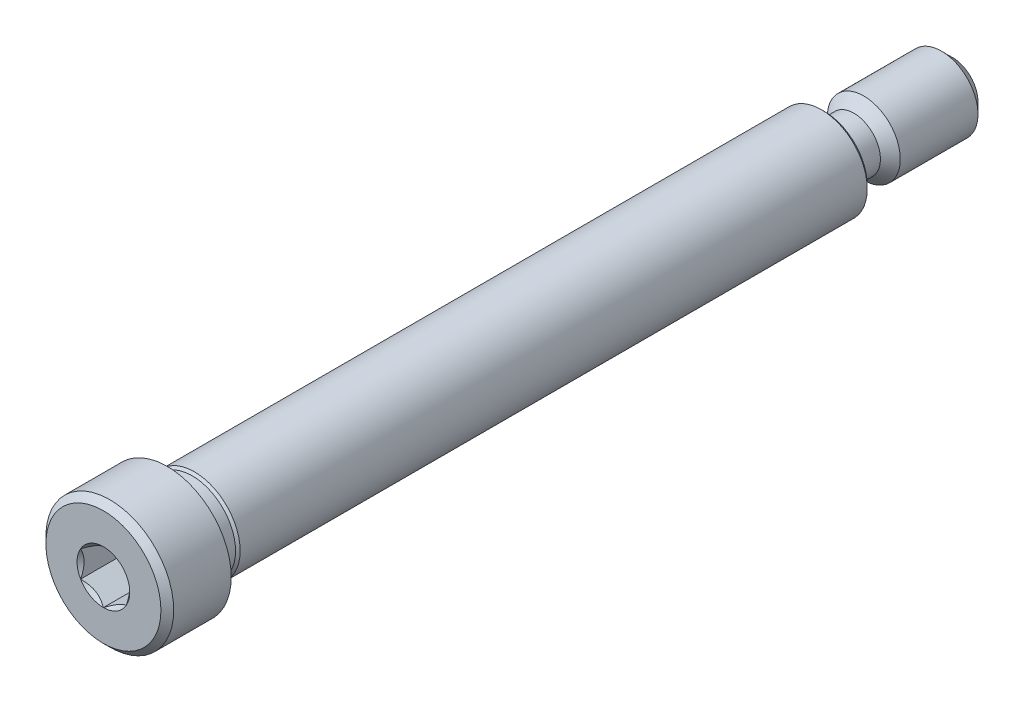
ISO-10303-21;
HEADER;
FILE_DESCRIPTION(('STEP AP214'),'2;1');
FILE_NAME('part.step','',(''),(''),'','','');
FILE_SCHEMA(('AUTOMOTIVE_DESIGN { 1 0 10303 214 1 1 1 1 }'));
ENDSEC;
DATA;
#1=APPLICATION_CONTEXT('core data for automotive mechanical design processes');
#2=APPLICATION_PROTOCOL_DEFINITION('international standard','automotive_design',2000,#1);
#3=PRODUCT_CONTEXT('',#1,'mechanical');
#4=PRODUCT('Part','Part','',(#3));
#5=PRODUCT_RELATED_PRODUCT_CATEGORY('part','',(#4));
#6=PRODUCT_DEFINITION_FORMATION('','',#4);
#7=PRODUCT_DEFINITION_CONTEXT('part definition',#1,'design');
#8=PRODUCT_DEFINITION('design','',#6,#7);
#9=PRODUCT_DEFINITION_SHAPE('','',#8);
#10=(LENGTH_UNIT() NAMED_UNIT(*) SI_UNIT(.MILLI.,.METRE.));
#11=(NAMED_UNIT(*) PLANE_ANGLE_UNIT() SI_UNIT($,.RADIAN.));
#12=(NAMED_UNIT(*) SI_UNIT($,.STERADIAN.) SOLID_ANGLE_UNIT());
#13=UNCERTAINTY_MEASURE_WITH_UNIT(LENGTH_MEASURE(1.E-05),#10,'distance_accuracy_value','');
#14=(GEOMETRIC_REPRESENTATION_CONTEXT(3) GLOBAL_UNCERTAINTY_ASSIGNED_CONTEXT((#13)) GLOBAL_UNIT_ASSIGNED_CONTEXT((#10,
#11,#12)) REPRESENTATION_CONTEXT('',''));
#15=CARTESIAN_POINT('',(0.,0.,0.));
#16=DIRECTION('',(0.,0.,1.));
#17=DIRECTION('',(1.,0.,0.));
#18=AXIS2_PLACEMENT_3D('',#15,#16,#17);
#19=CARTESIAN_POINT('',(0.,5.000625,36.909375));
#20=DIRECTION('',(0.,0.,-1.));
#21=DIRECTION('',(-1.,0.,0.));
#22=AXIS2_PLACEMENT_3D('',#19,#20,#21);
#23=PLANE('',#22);
#24=CARTESIAN_POINT('',(0.,0.,36.909375));
#25=DIRECTION('',(0.,0.,1.));
#26=DIRECTION('',(1.,0.,0.));
#27=AXIS2_PLACEMENT_3D('',#24,#25,#26);
#28=CIRCLE('',#27,2.29135888084633);
#29=CARTESIAN_POINT('',(-1.984375,1.14567944042316,36.909375));
#30=VERTEX_POINT('',#29);
#31=CARTESIAN_POINT('',(-1.984375,-1.14567944042316,36.909375));
#32=VERTEX_POINT('',#31);
#33=EDGE_CURVE('E144',#30,#32,#28,.T.);
#34=ORIENTED_EDGE('',*,*,#33,.F.);
#35=CARTESIAN_POINT('',(0.,2.29135888084633,36.909375));
#36=VERTEX_POINT('',#35);
#37=EDGE_CURVE('E136',#36,#30,#28,.T.);
#38=ORIENTED_EDGE('',*,*,#37,.F.);
#39=CARTESIAN_POINT('',(1.984375,1.14567944042317,36.909375));
#40=VERTEX_POINT('',#39);
#41=EDGE_CURVE('E106',#40,#36,#28,.T.);
#42=ORIENTED_EDGE('',*,*,#41,.F.);
#43=CARTESIAN_POINT('',(1.984375,-1.14567944042317,36.909375));
#44=VERTEX_POINT('',#43);
#45=EDGE_CURVE('E95',#44,#40,#28,.T.);
#46=ORIENTED_EDGE('',*,*,#45,.F.);
#47=CARTESIAN_POINT('',(0.,-2.29135888084633,36.909375));
#48=VERTEX_POINT('',#47);
#49=EDGE_CURVE('E56',#48,#44,#28,.T.);
#50=ORIENTED_EDGE('',*,*,#49,.F.);
#51=EDGE_CURVE('E63',#32,#48,#28,.T.);
#52=ORIENTED_EDGE('',*,*,#51,.F.);
#53=EDGE_LOOP('',(#34,#38,#42,#46,#50,#52));
#54=FACE_BOUND('',#53,.T.);
#55=CARTESIAN_POINT('',(0.,0.,36.909375));
#56=DIRECTION('',(0.,0.,1.));
#57=DIRECTION('',(1.,0.,0.));
#58=AXIS2_PLACEMENT_3D('',#55,#56,#57);
#59=CIRCLE('',#58,5.000625);
#60=CARTESIAN_POINT('',(5.000625,0.,36.909375));
#61=VERTEX_POINT('',#60);
#62=EDGE_CURVE('E50',#61,#61,#59,.T.);
#63=ORIENTED_EDGE('',*,*,#62,.T.);
#64=EDGE_LOOP('',(#63));
#65=FACE_BOUND('',#64,.T.);
#66=ADVANCED_FACE('F41',(#54,#65),#23,.F.);
#67=CARTESIAN_POINT('',(0.,0.,36.35375));
#68=DIRECTION('',(0.,0.,-1.));
#69=DIRECTION('',(-1.,0.,0.));
#70=AXIS2_PLACEMENT_3D('',#67,#68,#69);
#71=CONICAL_SURFACE('',#70,5.55625,0.785398163397445);
#72=ORIENTED_EDGE('',*,*,#62,.F.);
#73=EDGE_LOOP('',(#72));
#74=FACE_BOUND('',#73,.T.);
#75=CARTESIAN_POINT('',(0.,0.,36.35375));
#76=DIRECTION('',(0.,0.,1.));
#77=DIRECTION('',(1.,0.,0.));
#78=AXIS2_PLACEMENT_3D('',#75,#76,#77);
#79=CIRCLE('',#78,5.55625);
#80=CARTESIAN_POINT('',(5.55625,0.,36.35375));
#81=VERTEX_POINT('',#80);
#82=EDGE_CURVE('E332',#81,#81,#79,.T.);
#83=ORIENTED_EDGE('',*,*,#82,.T.);
#84=EDGE_LOOP('',(#83));
#85=FACE_BOUND('',#84,.T.);
#86=ADVANCED_FACE('F217',(#74,#85),#71,.T.);
#87=CARTESIAN_POINT('',(0.,0.,36.909375));
#88=DIRECTION('',(0.,0.,1.));
#89=DIRECTION('',(1.,0.,0.));
#90=AXIS2_PLACEMENT_3D('',#87,#88,#89);
#91=CYLINDRICAL_SURFACE('',#90,5.55625);
#92=ORIENTED_EDGE('',*,*,#82,.F.);
#93=EDGE_LOOP('',(#92));
#94=FACE_BOUND('',#93,.T.);
#95=CARTESIAN_POINT('',(0.,0.,31.353125));
#96=DIRECTION('',(0.,0.,1.));
#97=DIRECTION('',(1.,0.,0.));
#98=AXIS2_PLACEMENT_3D('',#95,#96,#97);
#99=CIRCLE('',#98,5.55625);
#100=CARTESIAN_POINT('',(5.55625,0.,31.353125));
#101=VERTEX_POINT('',#100);
#102=EDGE_CURVE('E328',#101,#101,#99,.T.);
#103=ORIENTED_EDGE('',*,*,#102,.T.);
#104=EDGE_LOOP('',(#103));
#105=FACE_BOUND('',#104,.T.);
#106=ADVANCED_FACE('F221',(#94,#105),#91,.T.);
#107=CARTESIAN_POINT('',(0.,5.55625,31.353125));
#108=DIRECTION('',(0.,0.,1.));
#109=DIRECTION('',(1.,0.,0.));
#110=AXIS2_PLACEMENT_3D('',#107,#108,#109);
#111=PLANE('',#110);
#112=ORIENTED_EDGE('',*,*,#102,.F.);
#113=EDGE_LOOP('',(#112));
#114=FACE_BOUND('',#113,.T.);
#115=CARTESIAN_POINT('',(0.,0.,31.353125));
#116=DIRECTION('',(0.,0.,1.));
#117=DIRECTION('',(1.,0.,0.));
#118=AXIS2_PLACEMENT_3D('',#115,#116,#117);
#119=CIRCLE('',#118,3.96875);
#120=CARTESIAN_POINT('',(3.96875,0.,31.353125));
#121=VERTEX_POINT('',#120);
#122=EDGE_CURVE('E324',#121,#121,#119,.T.);
#123=ORIENTED_EDGE('',*,*,#122,.T.);
#124=EDGE_LOOP('',(#123));
#125=FACE_BOUND('',#124,.T.);
#126=ADVANCED_FACE('F226',(#114,#125),#111,.F.);
#127=CARTESIAN_POINT('',(0.,0.,31.1546875));
#128=DIRECTION('',(0.,0.,1.));
#129=DIRECTION('',(1.,0.,0.));
#130=AXIS2_PLACEMENT_3D('',#127,#128,#129);
#131=CONICAL_SURFACE('',#130,3.7703125,0.785398163397443);
#132=ORIENTED_EDGE('',*,*,#122,.F.);
#133=EDGE_LOOP('',(#132));
#134=FACE_BOUND('',#133,.T.);
#135=CARTESIAN_POINT('',(0.,0.,31.1546875));
#136=DIRECTION('',(0.,0.,1.));
#137=DIRECTION('',(1.,0.,0.));
#138=AXIS2_PLACEMENT_3D('',#135,#136,#137);
#139=CIRCLE('',#138,3.7703125);
#140=CARTESIAN_POINT('',(3.7703125,0.,31.1546875));
#141=VERTEX_POINT('',#140);
#142=EDGE_CURVE('E320',#141,#141,#139,.T.);
#143=ORIENTED_EDGE('',*,*,#142,.T.);
#144=EDGE_LOOP('',(#143));
#145=FACE_BOUND('',#144,.T.);
#146=ADVANCED_FACE('F234',(#134,#145),#131,.T.);
#147=CARTESIAN_POINT('',(0.,0.,36.909375));
#148=DIRECTION('',(0.,0.,1.));
#149=DIRECTION('',(1.,0.,0.));
#150=AXIS2_PLACEMENT_3D('',#147,#148,#149);
#151=CYLINDRICAL_SURFACE('',#150,3.7703125);
#152=ORIENTED_EDGE('',*,*,#142,.F.);
#153=EDGE_LOOP('',(#152));
#154=FACE_BOUND('',#153,.T.);
#155=CARTESIAN_POINT('',(0.,0.,29.1893625));
#156=DIRECTION('',(0.,0.,1.));
#157=DIRECTION('',(1.,0.,0.));
#158=AXIS2_PLACEMENT_3D('',#155,#156,#157);
#159=CIRCLE('',#158,3.7703125);
#160=CARTESIAN_POINT('',(3.7703125,0.,29.1893625));
#161=VERTEX_POINT('',#160);
#162=EDGE_CURVE('E316',#161,#161,#159,.T.);
#163=ORIENTED_EDGE('',*,*,#162,.T.);
#164=EDGE_LOOP('',(#163));
#165=FACE_BOUND('',#164,.T.);
#166=ADVANCED_FACE('F238',(#154,#165),#151,.T.);
#167=CARTESIAN_POINT('',(0.,0.,28.990925));
#168=DIRECTION('',(0.,0.,-1.));
#169=DIRECTION('',(-1.,0.,0.));
#170=AXIS2_PLACEMENT_3D('',#167,#168,#169);
#171=CONICAL_SURFACE('',#170,3.96875,0.785398163397442);
#172=ORIENTED_EDGE('',*,*,#162,.F.);
#173=EDGE_LOOP('',(#172));
#174=FACE_BOUND('',#173,.T.);
#175=CARTESIAN_POINT('',(0.,0.,28.990925));
#176=DIRECTION('',(0.,0.,1.));
#177=DIRECTION('',(1.,0.,0.));
#178=AXIS2_PLACEMENT_3D('',#175,#176,#177);
#179=CIRCLE('',#178,3.96875);
#180=CARTESIAN_POINT('',(3.96875,0.,28.990925));
#181=VERTEX_POINT('',#180);
#182=EDGE_CURVE('E312',#181,#181,#179,.T.);
#183=ORIENTED_EDGE('',*,*,#182,.T.);
#184=EDGE_LOOP('',(#183));
#185=FACE_BOUND('',#184,.T.);
#186=ADVANCED_FACE('F242',(#174,#185),#171,.T.);
#187=CARTESIAN_POINT('',(0.,0.,36.909375));
#188=DIRECTION('',(0.,0.,1.));
#189=DIRECTION('',(1.,0.,0.));
#190=AXIS2_PLACEMENT_3D('',#187,#188,#189);
#191=CYLINDRICAL_SURFACE('',#190,3.96875);
#192=ORIENTED_EDGE('',*,*,#182,.F.);
#193=EDGE_LOOP('',(#192));
#194=FACE_BOUND('',#193,.T.);
#195=CARTESIAN_POINT('',(0.,0.,-25.5322916666667));
#196=DIRECTION('',(0.,0.,1.));
#197=DIRECTION('',(1.,0.,0.));
#198=AXIS2_PLACEMENT_3D('',#195,#196,#197);
#199=CIRCLE('',#198,3.96875);
#200=CARTESIAN_POINT('',(3.96875,0.,-25.5322916666667));
#201=VERTEX_POINT('',#200);
#202=EDGE_CURVE('E308',#201,#201,#199,.T.);
#203=ORIENTED_EDGE('',*,*,#202,.T.);
#204=EDGE_LOOP('',(#203));
#205=FACE_BOUND('',#204,.T.);
#206=ADVANCED_FACE('F246',(#194,#205),#191,.T.);
#207=CARTESIAN_POINT('',(0.,0.,-25.796875));
#208=DIRECTION('',(0.,0.,1.));
#209=DIRECTION('',(1.,0.,0.));
#210=AXIS2_PLACEMENT_3D('',#207,#208,#209);
#211=CONICAL_SURFACE('',#210,3.70416666666667,0.785398163397452);
#212=ORIENTED_EDGE('',*,*,#202,.F.);
#213=EDGE_LOOP('',(#212));
#214=FACE_BOUND('',#213,.T.);
#215=CARTESIAN_POINT('',(0.,0.,-25.796875));
#216=DIRECTION('',(0.,0.,1.));
#217=DIRECTION('',(1.,0.,0.));
#218=AXIS2_PLACEMENT_3D('',#215,#216,#217);
#219=CIRCLE('',#218,3.70416666666667);
#220=CARTESIAN_POINT('',(3.70416666666667,0.,-25.796875));
#221=VERTEX_POINT('',#220);
#222=EDGE_CURVE('E291',#221,#221,#219,.T.);
#223=ORIENTED_EDGE('',*,*,#222,.T.);
#224=EDGE_LOOP('',(#223));
#225=FACE_BOUND('',#224,.T.);
#226=ADVANCED_FACE('F250',(#214,#225),#211,.T.);
#227=CARTESIAN_POINT('',(0.,3.70416666666667,-25.796875));
#228=DIRECTION('',(0.,0.,1.));
#229=DIRECTION('',(1.,0.,0.));
#230=AXIS2_PLACEMENT_3D('',#227,#228,#229);
#231=PLANE('',#230);
#232=CARTESIAN_POINT('',(0.,0.,-25.796875));
#233=DIRECTION('',(0.,0.,-1.));
#234=DIRECTION('',(-1.,0.,0.));
#235=AXIS2_PLACEMENT_3D('',#232,#233,#234);
#236=CIRCLE('',#235,3.175);
#237=CARTESIAN_POINT('',(-3.175,0.,-25.796875));
#238=VERTEX_POINT('',#237);
#239=EDGE_CURVE('E566',#238,#238,#236,.T.);
#240=ORIENTED_EDGE('',*,*,#239,.F.);
#241=EDGE_LOOP('',(#240));
#242=FACE_BOUND('',#241,.T.);
#243=ORIENTED_EDGE('',*,*,#222,.F.);
#244=EDGE_LOOP('',(#243));
#245=FACE_BOUND('',#244,.T.);
#246=ADVANCED_FACE('F254',(#242,#245),#231,.F.);
#247=CARTESIAN_POINT('',(0.,0.,36.909375));
#248=DIRECTION('',(0.,0.,1.));
#249=DIRECTION('',(1.,0.,0.));
#250=AXIS2_PLACEMENT_3D('',#247,#248,#249);
#251=CONICAL_SURFACE('',#250,2.29135888084633,0.78539816339745);
#252=ORIENTED_EDGE('',*,*,#41,.T.);
#253=CARTESIAN_POINT('',(1.984575,1.14556397036933,36.9094904787818));
#254=CARTESIAN_POINT('',(1.91635900483319,1.18494849354192,36.8701378522639));
#255=CARTESIAN_POINT('',(1.84700231489303,1.22499159714897,36.8330963104462));
#256=CARTESIAN_POINT('',(1.70557619954781,1.30664400291398,36.7652738584233));
#257=CARTESIAN_POINT('',(1.63349332126322,1.34826107209555,36.7345306890918));
#258=CARTESIAN_POINT('',(1.488141602734,1.43217992591557,36.6818668888112));
#259=CARTESIAN_POINT('',(1.41490978751306,1.47446033414663,36.65981387588));
#260=CARTESIAN_POINT('',(1.2668338174053,1.55995203534886,36.6258364929439));
#261=CARTESIAN_POINT('',(1.19199418724658,1.60316071596705,36.6138867560917));
#262=CARTESIAN_POINT('',(1.06301458545619,1.6776271237807,36.6031050990819));
#263=CARTESIAN_POINT('',(1.00904128422756,1.7087886237741,36.6015088990591));
#264=CARTESIAN_POINT('',(0.9011828814802,1.77106070163465,36.6041968388653));
#265=CARTESIAN_POINT('',(0.847297817514477,1.80217125782056,36.6084830403405));
#266=CARTESIAN_POINT('',(0.740036461751397,1.86409863044402,36.6226918730135));
#267=CARTESIAN_POINT('',(0.68666080723986,1.89491507894443,36.6326208104523));
#268=CARTESIAN_POINT('',(0.580832482591104,1.95601509066828,36.6575700842745));
#269=CARTESIAN_POINT('',(0.528379742028899,1.9862986945516,36.6725900303895));
#270=CARTESIAN_POINT('',(0.394017661036352,2.06387267818152,36.7171828516357));
#271=CARTESIAN_POINT('',(0.312941642841677,2.11068193911104,36.7501179959383));
#272=CARTESIAN_POINT('',(0.193726693270163,2.17951072233758,36.8057174412022));
#273=CARTESIAN_POINT('',(0.154440075614001,2.20219286161692,36.8252525920519));
#274=CARTESIAN_POINT('',(0.0765946381319502,2.24713694590237,36.8661037381194));
#275=CARTESIAN_POINT('',(0.0380353888983047,2.26939913882716,36.8874186395684));
#276=CARTESIAN_POINT('',(-0.000199999999996856,2.29147435090016,36.9094904787818));
#277=B_SPLINE_CURVE_WITH_KNOTS('',3,(#253,#254,#255,#256,#257,#258,#259,#260,#261,#262,#263,
#264,#265,#266,#267,#268,#269,#270,#271,#272,#273,#274,#275,#276),.UNSPECIFIED.,.F.,.F.,(4,2,2,
2,2,2,2,2,2,2,2,4),(0.,0.264339630306627,0.530219665093692,0.791876416371457,1.05287424418109,
1.239639843932,1.42647091743852,1.61351120244034,1.8005371524754,2.09764209964316,
2.24579179873713,2.39385111134157),.UNSPECIFIED.);
#278=EDGE_CURVE('E11',#40,#36,#277,.T.);
#279=ORIENTED_EDGE('',*,*,#278,.F.);
#280=EDGE_LOOP('',(#252,#279));
#281=FACE_BOUND('',#280,.T.);
#282=ADVANCED_FACE('F109',(#281),#251,.F.);
#283=ORIENTED_EDGE('',*,*,#37,.T.);
#284=CARTESIAN_POINT('',(0.000200000000000114,2.29147435090017,36.9094904787818));
#285=CARTESIAN_POINT('',(-0.0680159951668045,2.25208982772757,36.8701378522639));
#286=CARTESIAN_POINT('',(-0.137372685106969,2.21204672412052,36.8330963104462));
#287=CARTESIAN_POINT('',(-0.278798800452189,2.13039431835551,36.7652738584233));
#288=CARTESIAN_POINT('',(-0.350881678736783,2.08877724917394,36.7345306890918));
#289=CARTESIAN_POINT('',(-0.496233397266004,2.00485839535392,36.6818668888112));
#290=CARTESIAN_POINT('',(-0.569465212486938,1.96257798712287,36.65981387588));
#291=CARTESIAN_POINT('',(-0.717541182594707,1.87708628592063,36.6258364929439));
#292=CARTESIAN_POINT('',(-0.792380812753425,1.83387760530244,36.6138867560917));
#293=CARTESIAN_POINT('',(-0.921360414543817,1.75941119748879,36.6031050990819));
#294=CARTESIAN_POINT('',(-0.975333715772444,1.72824969749539,36.6015088990591));
#295=CARTESIAN_POINT('',(-1.0831921185198,1.66597761963484,36.6041968388653));
#296=CARTESIAN_POINT('',(-1.13707718248552,1.63486706344893,36.6084830403405));
#297=CARTESIAN_POINT('',(-1.24433853824861,1.57293969082547,36.6226918730135));
#298=CARTESIAN_POINT('',(-1.29771419276014,1.54212324232506,36.6326208104523));
#299=CARTESIAN_POINT('',(-1.4035425174089,1.48102323060122,36.6575700842745));
#300=CARTESIAN_POINT('',(-1.4559952579711,1.45073962671789,36.6725900303895));
#301=CARTESIAN_POINT('',(-1.59035733896365,1.37316564308797,36.7171828516357));
#302=CARTESIAN_POINT('',(-1.67143335715833,1.32635638215845,36.7501179959383));
#303=CARTESIAN_POINT('',(-1.79064830672984,1.25752759893191,36.8057174412022));
#304=CARTESIAN_POINT('',(-1.829934924386,1.23484545965257,36.8252525920519));
#305=CARTESIAN_POINT('',(-1.90778036186805,1.18990137536713,36.8661037381194));
#306=CARTESIAN_POINT('',(-1.9463396111017,1.16763918244233,36.8874186395684));
#307=CARTESIAN_POINT('',(-1.984575,1.14556397036933,36.9094904787818));
#308=B_SPLINE_CURVE_WITH_KNOTS('',3,(#284,#285,#286,#287,#288,#289,#290,#291,#292,#293,#294,
#295,#296,#297,#298,#299,#300,#301,#302,#303,#304,#305,#306,#307),.UNSPECIFIED.,.F.,.F.,(4,2,2,
2,2,2,2,2,2,2,2,4),(0.,0.264339630306628,0.530219665093694,0.79187641637146,1.05287424418109,
1.239639843932,1.42647091743852,1.61351120244035,1.8005371524754,2.09764209964317,
2.24579179873714,2.39385111134157),.UNSPECIFIED.);
#309=EDGE_CURVE('E138',#36,#30,#308,.T.);
#310=ORIENTED_EDGE('',*,*,#309,.F.);
#311=EDGE_LOOP('',(#283,#310));
#312=FACE_BOUND('',#311,.T.);
#313=ADVANCED_FACE('F372',(#312),#251,.F.);
#314=ORIENTED_EDGE('',*,*,#33,.T.);
#315=CARTESIAN_POINT('',(-1.984375,-2.28495242157822,37.6443590788166));
#316=CARTESIAN_POINT('',(-1.984375,-2.22931635455401,37.6023616855508));
#317=CARTESIAN_POINT('',(-1.984375,-2.17336876548389,37.5607710540763));
#318=CARTESIAN_POINT('',(-1.984375,-2.0607277025817,37.4785834614715));
#319=CARTESIAN_POINT('',(-1.984375,-2.00403404503434,37.437986752405));
#320=CARTESIAN_POINT('',(-1.984375,-1.88936329173488,37.3576785031747));
#321=CARTESIAN_POINT('',(-1.984375,-1.83137965519348,37.3179762588133));
#322=CARTESIAN_POINT('',(-1.984375,-1.7144280213784,37.2400601734013));
#323=CARTESIAN_POINT('',(-1.984375,-1.65546009407228,37.2018462271944));
#324=CARTESIAN_POINT('',(-1.984375,-1.47005472306035,37.0856278340136));
#325=CARTESIAN_POINT('',(-1.984375,-1.34163909427883,37.0107228868724));
#326=CARTESIAN_POINT('',(-1.984375,-1.07840384705479,36.8737052154397));
#327=CARTESIAN_POINT('',(-1.984375,-0.943607781407422,36.8115493664824));
#328=CARTESIAN_POINT('',(-1.984375,-0.74127510044488,36.7355075786886));
#329=CARTESIAN_POINT('',(-1.984375,-0.676735408881094,36.713683061326));
#330=CARTESIAN_POINT('',(-1.984375,-0.54609811811276,36.6752154635378));
#331=CARTESIAN_POINT('',(-1.984375,-0.480000411919954,36.6585727400656));
#332=CARTESIAN_POINT('',(-1.984375,-0.347746170028529,36.6316103808697));
#333=CARTESIAN_POINT('',(-1.984375,-0.281612071479119,36.6211824097359));
#334=CARTESIAN_POINT('',(-1.984375,-0.148636620052346,36.6068531473766));
#335=CARTESIAN_POINT('',(-1.984375,-0.0817953907393188,36.6029507342274));
#336=CARTESIAN_POINT('',(-1.984375,0.0495156750890701,36.6019620513327));
#337=CARTESIAN_POINT('',(-1.984375,0.113983775102997,36.604634178875));
#338=CARTESIAN_POINT('',(-1.984375,0.242367515846183,36.6161142104975));
#339=CARTESIAN_POINT('',(-1.984375,0.306283102295925,36.6249227106392));
#340=CARTESIAN_POINT('',(-1.984375,0.43418104026219,36.6483440213329));
#341=CARTESIAN_POINT('',(-1.984375,0.498145026858316,36.6630556062321));
#342=CARTESIAN_POINT('',(-1.984375,0.624675616953013,36.6975011814121));
#343=CARTESIAN_POINT('',(-1.984375,0.687242336899694,36.7172347514492));
#344=CARTESIAN_POINT('',(-1.984375,0.884225483826092,36.7867872372308));
#345=CARTESIAN_POINT('',(-1.984375,1.01583674256469,36.8445274112565));
#346=CARTESIAN_POINT('',(-1.984375,1.27288659242652,36.9729053365888));
#347=CARTESIAN_POINT('',(-1.984375,1.3983008827048,37.0435894249194));
#348=CARTESIAN_POINT('',(-1.984375,1.57956687990222,37.1538916638132));
#349=CARTESIAN_POINT('',(-1.984375,1.63738271299425,37.1903448294754));
#350=CARTESIAN_POINT('',(-1.984375,1.75202215386203,37.2647909632917));
#351=CARTESIAN_POINT('',(-1.984375,1.80884568601363,37.3027840480781));
#352=CARTESIAN_POINT('',(-1.984375,1.92116923084256,37.3797138088931));
#353=CARTESIAN_POINT('',(-1.984375,1.97667624512255,37.4186403130388));
#354=CARTESIAN_POINT('',(-1.984375,2.08693170717168,37.4975227461214));
#355=CARTESIAN_POINT('',(-1.984375,2.14168035934794,37.537478389024));
#356=CARTESIAN_POINT('',(-1.984375,2.19611149046623,37.5778556112854));
#357=B_SPLINE_CURVE_WITH_KNOTS('',3,(#315,#316,#317,#318,#319,#320,#321,#322,#323,#324,#325,
#326,#327,#328,#329,#330,#331,#332,#333,#334,#335,#336,#337,#338,#339,#340,#341,#342,#343,#344,
#345,#346,#347,#348,#349,#350,#351,#352,#353,#354,#355,#356),.UNSPECIFIED.,.F.,.F.,(4,2,2,2,2,2,
2,2,2,2,2,2,2,2,2,2,2,2,2,2,4),(0.,0.209126070008321,0.418304637356568,0.629103979977992,
0.839888401371176,1.28549951116127,1.72957750768351,1.93379389749971,2.13802435186698,
2.33858179514333,2.53910475350639,2.73236963400794,2.92565329006887,3.12231577097487,
3.31896180041345,3.74886295245172,4.18033428125363,4.3853601718029,4.59040161996383,
4.79377749165109,4.99709743524132),.UNSPECIFIED.);
#358=EDGE_CURVE('E142',#30,#32,#357,.F.);
#359=ORIENTED_EDGE('',*,*,#358,.F.);
#360=EDGE_LOOP('',(#314,#359));
#361=FACE_BOUND('',#360,.T.);
#362=ADVANCED_FACE('F363',(#361),#251,.F.);
#363=ORIENTED_EDGE('',*,*,#51,.T.);
#364=CARTESIAN_POINT('',(-1.984575,-1.14556397036933,36.9094904787818));
#365=CARTESIAN_POINT('',(-1.9163590048332,-1.18494849354192,36.8701378522639));
#366=CARTESIAN_POINT('',(-1.84700231489303,-1.22499159714897,36.8330963104462));
#367=CARTESIAN_POINT('',(-1.70557619954781,-1.30664400291398,36.7652738584233));
#368=CARTESIAN_POINT('',(-1.63349332126322,-1.34826107209555,36.7345306890918));
#369=CARTESIAN_POINT('',(-1.488141602734,-1.43217992591557,36.6818668888112));
#370=CARTESIAN_POINT('',(-1.41490978751306,-1.47446033414663,36.65981387588));
#371=CARTESIAN_POINT('',(-1.26683381740529,-1.55995203534886,36.6258364929439));
#372=CARTESIAN_POINT('',(-1.19199418724657,-1.60316071596705,36.6138867560917));
#373=CARTESIAN_POINT('',(-1.06301458545618,-1.6776271237807,36.6031050990819));
#374=CARTESIAN_POINT('',(-1.00904128422755,-1.7087886237741,36.6015088990591));
#375=CARTESIAN_POINT('',(-0.901182881480196,-1.77106070163465,36.6041968388653));
#376=CARTESIAN_POINT('',(-0.847297817514473,-1.80217125782056,36.6084830403405));
#377=CARTESIAN_POINT('',(-0.740036461751393,-1.86409863044402,36.6226918730135));
#378=CARTESIAN_POINT('',(-0.686660807239856,-1.89491507894443,36.6326208104523));
#379=CARTESIAN_POINT('',(-0.5808324825911,-1.95601509066828,36.6575700842745));
#380=CARTESIAN_POINT('',(-0.528379742028895,-1.9862986945516,36.6725900303895));
#381=CARTESIAN_POINT('',(-0.394017661036349,-2.06387267818153,36.7171828516357));
#382=CARTESIAN_POINT('',(-0.312941642841674,-2.11068193911104,36.7501179959383));
#383=CARTESIAN_POINT('',(-0.193726693270161,-2.17951072233758,36.8057174412022));
#384=CARTESIAN_POINT('',(-0.154440075614,-2.20219286161692,36.8252525920519));
#385=CARTESIAN_POINT('',(-0.0765946381319492,-2.24713694590237,36.8661037381194));
#386=CARTESIAN_POINT('',(-0.0380353888983039,-2.26939913882716,36.8874186395683));
#387=CARTESIAN_POINT('',(0.000199999999997345,-2.29147435090016,36.9094904787818));
#388=B_SPLINE_CURVE_WITH_KNOTS('',3,(#364,#365,#366,#367,#368,#369,#370,#371,#372,#373,#374,
#375,#376,#377,#378,#379,#380,#381,#382,#383,#384,#385,#386,#387),.UNSPECIFIED.,.F.,.F.,(4,2,2,
2,2,2,2,2,2,2,2,4),(0.,0.264339630306628,0.530219665093695,0.791876416371461,1.05287424418109,
1.239639843932,1.42647091743853,1.61351120244035,1.80053715247541,2.09764209964316,
2.24579179873713,2.39385111134157),.UNSPECIFIED.);
#389=EDGE_CURVE('E182',#32,#48,#388,.T.);
#390=ORIENTED_EDGE('',*,*,#389,.F.);
#391=EDGE_LOOP('',(#363,#390));
#392=FACE_BOUND('',#391,.T.);
#393=ADVANCED_FACE('F364',(#392),#251,.F.);
#394=ORIENTED_EDGE('',*,*,#49,.T.);
#395=CARTESIAN_POINT('',(-0.000200000000000085,-2.29147435090017,36.9094904787818));
#396=CARTESIAN_POINT('',(0.0680159951668043,-2.25208982772757,36.8701378522639));
#397=CARTESIAN_POINT('',(0.137372685106968,-2.21204672412052,36.8330963104462));
#398=CARTESIAN_POINT('',(0.278798800452189,-2.13039431835551,36.7652738584233));
#399=CARTESIAN_POINT('',(0.350881678736783,-2.08877724917394,36.7345306890918));
#400=CARTESIAN_POINT('',(0.496233397266003,-2.00485839535392,36.6818668888112));
#401=CARTESIAN_POINT('',(0.569465212486938,-1.96257798712287,36.65981387588));
#402=CARTESIAN_POINT('',(0.717541182594707,-1.87708628592063,36.6258364929439));
#403=CARTESIAN_POINT('',(0.792380812753426,-1.83387760530244,36.6138867560917));
#404=CARTESIAN_POINT('',(0.921360414543817,-1.75941119748879,36.6031050990819));
#405=CARTESIAN_POINT('',(0.975333715772444,-1.72824969749539,36.6015088990591));
#406=CARTESIAN_POINT('',(1.0831921185198,-1.66597761963484,36.6041968388653));
#407=CARTESIAN_POINT('',(1.13707718248553,-1.63486706344893,36.6084830403405));
#408=CARTESIAN_POINT('',(1.24433853824861,-1.57293969082547,36.6226918730135));
#409=CARTESIAN_POINT('',(1.29771419276014,-1.54212324232506,36.6326208104523));
#410=CARTESIAN_POINT('',(1.4035425174089,-1.48102323060122,36.6575700842745));
#411=CARTESIAN_POINT('',(1.4559952579711,-1.45073962671789,36.6725900303895));
#412=CARTESIAN_POINT('',(1.59035733896365,-1.37316564308797,36.7171828516357));
#413=CARTESIAN_POINT('',(1.67143335715832,-1.32635638215845,36.7501179959383));
#414=CARTESIAN_POINT('',(1.79064830672984,-1.25752759893191,36.8057174412022));
#415=CARTESIAN_POINT('',(1.829934924386,-1.23484545965257,36.8252525920519));
#416=CARTESIAN_POINT('',(1.90778036186805,-1.18990137536713,36.8661037381194));
#417=CARTESIAN_POINT('',(1.9463396111017,-1.16763918244233,36.8874186395683));
#418=CARTESIAN_POINT('',(1.984575,-1.14556397036933,36.9094904787818));
#419=B_SPLINE_CURVE_WITH_KNOTS('',3,(#395,#396,#397,#398,#399,#400,#401,#402,#403,#404,#405,
#406,#407,#408,#409,#410,#411,#412,#413,#414,#415,#416,#417,#418),.UNSPECIFIED.,.F.,.F.,(4,2,2,
2,2,2,2,2,2,2,2,4),(0.,0.264339630306628,0.530219665093694,0.79187641637146,1.05287424418109,
1.239639843932,1.42647091743852,1.61351120244035,1.8005371524754,2.09764209964316,
2.24579179873713,2.39385111134157),.UNSPECIFIED.);
#420=EDGE_CURVE('E122',#48,#44,#419,.T.);
#421=ORIENTED_EDGE('',*,*,#420,.F.);
#422=EDGE_LOOP('',(#394,#421));
#423=FACE_BOUND('',#422,.T.);
#424=ADVANCED_FACE('F168',(#423),#251,.F.);
#425=ORIENTED_EDGE('',*,*,#45,.T.);
#426=CARTESIAN_POINT('',(1.984375,-2.28495242191066,37.6443590790676));
#427=CARTESIAN_POINT('',(1.984375,-2.22931635487713,37.6023616857921));
#428=CARTESIAN_POINT('',(1.984375,-2.17336876579765,37.560771054308));
#429=CARTESIAN_POINT('',(1.984375,-2.06072770287666,37.4785834616839));
#430=CARTESIAN_POINT('',(1.984375,-2.00403404531985,37.4379867526079));
#431=CARTESIAN_POINT('',(1.984375,-1.88936329200117,37.3576785033582));
#432=CARTESIAN_POINT('',(1.984375,-1.83137965544999,37.3179762589872));
#433=CARTESIAN_POINT('',(1.984375,-1.71442802161519,37.240060173556));
#434=CARTESIAN_POINT('',(1.984375,-1.65546009429911,37.2018462273396));
#435=CARTESIAN_POINT('',(1.984375,-1.47005472325436,37.0856278341287));
#436=CARTESIAN_POINT('',(1.984375,-1.34163909444949,37.0107228869673));
#437=CARTESIAN_POINT('',(1.984375,-1.07840384717678,36.8737052154972));
#438=CARTESIAN_POINT('',(1.984375,-0.943607781504094,36.8115493665226));
#439=CARTESIAN_POINT('',(1.984375,-0.741275100522506,36.735507578716));
#440=CARTESIAN_POINT('',(1.984375,-0.676735408966694,36.7136830613539));
#441=CARTESIAN_POINT('',(1.984375,-0.546098118214572,36.6752154635651));
#442=CARTESIAN_POINT('',(1.984375,-0.480000412030003,36.6585727400917));
#443=CARTESIAN_POINT('',(1.984375,-0.347746170154779,36.6316103808918));
#444=CARTESIAN_POINT('',(1.984375,-0.281612071613331,36.621182409755));
#445=CARTESIAN_POINT('',(1.984375,-0.148636620202213,36.6068531473881));
#446=CARTESIAN_POINT('',(1.984375,-0.0817953908968822,36.6029507342341));
#447=CARTESIAN_POINT('',(1.984375,0.0495156749173087,36.6019620513286));
#448=CARTESIAN_POINT('',(1.984375,0.113983774924714,36.604634178865));
#449=CARTESIAN_POINT('',(1.984375,0.242367515655507,36.6161142104746));
#450=CARTESIAN_POINT('',(1.984375,0.306283102099381,36.6249227106094));
#451=CARTESIAN_POINT('',(1.984375,0.434181040054057,36.6483440212885));
#452=CARTESIAN_POINT('',(1.984375,0.498145026644482,36.6630556061801));
#453=CARTESIAN_POINT('',(1.984375,0.624675616728329,36.6975011813447));
#454=CARTESIAN_POINT('',(1.984375,0.68724233666986,36.717234751374));
#455=CARTESIAN_POINT('',(1.984375,0.884225483546216,36.7867872371188));
#456=CARTESIAN_POINT('',(1.984375,1.01583674224242,36.8445274111108));
#457=CARTESIAN_POINT('',(1.984375,1.27288659202274,36.9729053363718));
#458=CARTESIAN_POINT('',(1.984375,1.39830088226191,37.0435894246649));
#459=CARTESIAN_POINT('',(1.984375,1.57956687940504,37.1538916635037));
#460=CARTESIAN_POINT('',(1.984375,1.63738271248119,37.1903448291489));
#461=CARTESIAN_POINT('',(1.984375,1.75202215331743,37.2647909629313));
#462=CARTESIAN_POINT('',(1.984375,1.80884568545337,37.3027840477007));
#463=CARTESIAN_POINT('',(1.984375,1.92116923025137,37.3797138084819));
#464=CARTESIAN_POINT('',(1.984375,1.97667624451607,37.4186403126108));
#465=CARTESIAN_POINT('',(1.984375,2.08693170653474,37.4975227456598));
#466=CARTESIAN_POINT('',(1.984375,2.14168035869582,37.5374783885457));
#467=CARTESIAN_POINT('',(1.984375,2.19611148979895,37.5778556107903));
#468=B_SPLINE_CURVE_WITH_KNOTS('',3,(#426,#427,#428,#429,#430,#431,#432,#433,#434,#435,#436,
#437,#438,#439,#440,#441,#442,#443,#444,#445,#446,#447,#448,#449,#450,#451,#452,#453,#454,#455,
#456,#457,#458,#459,#460,#461,#462,#463,#464,#465,#466,#467),.UNSPECIFIED.,.F.,.F.,(4,2,2,2,2,2,
2,2,2,2,2,2,2,2,2,2,2,2,2,2,4),(0.,0.209126070048123,0.418304637436185,0.62910398009817,
0.839888401531923,1.28549951141298,1.72957750802533,1.93379389781847,2.13802435216271,
2.33858179541698,2.53910475375795,2.73236963423929,2.92565329027999,3.12231577116421,
3.31896180058102,3.7488629524628,4.18033428110719,4.38536017158908,4.59040161968262,
4.7937774913034,4.99709743482716),.UNSPECIFIED.);
#469=EDGE_CURVE('E99',#44,#40,#468,.T.);
#470=ORIENTED_EDGE('',*,*,#469,.F.);
#471=EDGE_LOOP('',(#425,#470));
#472=FACE_BOUND('',#471,.T.);
#473=ADVANCED_FACE('F97',(#472),#251,.F.);
#474=CARTESIAN_POINT('',(0.,0.,32.7421875));
#475=DIRECTION('',(0.,0.,1.));
#476=DIRECTION('',(1.,0.,0.));
#477=AXIS2_PLACEMENT_3D('',#474,#475,#476);
#478=PLANE('',#477);
#479=DIRECTION('',(0.,1.,0.));
#480=VECTOR('',#479,1.);
#481=CARTESIAN_POINT('',(1.984375,-1.14567944042317,32.7421875));
#482=LINE('',#481,#480);
#483=CARTESIAN_POINT('',(1.984375,-1.14567944042317,32.7421875));
#484=VERTEX_POINT('',#483);
#485=CARTESIAN_POINT('',(1.984375,1.14567944042317,32.7421875));
#486=VERTEX_POINT('',#485);
#487=EDGE_CURVE('E121',#484,#486,#482,.T.);
#488=ORIENTED_EDGE('',*,*,#487,.T.);
#489=DIRECTION('',(-0.866025403784439,0.5,0.));
#490=VECTOR('',#489,1.);
#491=CARTESIAN_POINT('',(1.984375,1.14567944042317,32.7421875));
#492=LINE('',#491,#490);
#493=CARTESIAN_POINT('',(0.,2.29135888084633,32.7421875));
#494=VERTEX_POINT('',#493);
#495=EDGE_CURVE('E126',#486,#494,#492,.T.);
#496=ORIENTED_EDGE('',*,*,#495,.T.);
#497=DIRECTION('',(-0.866025403784439,-0.5,0.));
#498=VECTOR('',#497,1.);
#499=CARTESIAN_POINT('',(0.,2.29135888084633,32.7421875));
#500=LINE('',#499,#498);
#501=CARTESIAN_POINT('',(-1.984375,1.14567944042316,32.7421875));
#502=VERTEX_POINT('',#501);
#503=EDGE_CURVE('E275',#494,#502,#500,.T.);
#504=ORIENTED_EDGE('',*,*,#503,.T.);
#505=DIRECTION('',(0.,-1.,0.));
#506=VECTOR('',#505,1.);
#507=CARTESIAN_POINT('',(-1.984375,1.14567944042316,32.7421875));
#508=LINE('',#507,#506);
#509=CARTESIAN_POINT('',(-1.984375,-1.14567944042316,32.7421875));
#510=VERTEX_POINT('',#509);
#511=EDGE_CURVE('E280',#502,#510,#508,.T.);
#512=ORIENTED_EDGE('',*,*,#511,.T.);
#513=DIRECTION('',(0.866025403784439,-0.5,0.));
#514=VECTOR('',#513,1.);
#515=CARTESIAN_POINT('',(-1.984375,-1.14567944042316,32.7421875));
#516=LINE('',#515,#514);
#517=CARTESIAN_POINT('',(0.,-2.29135888084633,32.7421875));
#518=VERTEX_POINT('',#517);
#519=EDGE_CURVE('E284',#510,#518,#516,.T.);
#520=ORIENTED_EDGE('',*,*,#519,.T.);
#521=DIRECTION('',(0.866025403784439,0.5,0.));
#522=VECTOR('',#521,1.);
#523=CARTESIAN_POINT('',(0.,-2.29135888084633,32.7421875));
#524=LINE('',#523,#522);
#525=EDGE_CURVE('E130',#518,#484,#524,.T.);
#526=ORIENTED_EDGE('',*,*,#525,.T.);
#527=EDGE_LOOP('',(#488,#496,#504,#512,#520,#526));
#528=FACE_BOUND('',#527,.T.);
#529=ADVANCED_FACE('F167',(#528),#478,.T.);
#530=CARTESIAN_POINT('',(1.984375,1.14567944042317,32.7421875));
#531=DIRECTION('',(0.5,0.866025403784439,0.));
#532=DIRECTION('',(-0.866025403784439,0.5,0.));
#533=AXIS2_PLACEMENT_3D('',#530,#531,#532);
#534=PLANE('',#533);
#535=DIRECTION('',(0.,0.,1.));
#536=VECTOR('',#535,1.);
#537=CARTESIAN_POINT('',(1.984375,1.14567944042317,32.7421875));
#538=LINE('',#537,#536);
#539=EDGE_CURVE('E117',#486,#40,#538,.T.);
#540=ORIENTED_EDGE('',*,*,#539,.T.);
#541=ORIENTED_EDGE('',*,*,#278,.T.);
#542=DIRECTION('',(0.,0.,1.));
#543=VECTOR('',#542,1.);
#544=CARTESIAN_POINT('',(0.,2.29135888084633,32.7421875));
#545=LINE('',#544,#543);
#546=EDGE_CURVE('E129',#494,#36,#545,.T.);
#547=ORIENTED_EDGE('',*,*,#546,.F.);
#548=ORIENTED_EDGE('',*,*,#495,.F.);
#549=EDGE_LOOP('',(#540,#541,#547,#548));
#550=FACE_BOUND('',#549,.T.);
#551=ADVANCED_FACE('F124',(#550),#534,.F.);
#552=CARTESIAN_POINT('',(0.,2.29135888084633,32.7421875));
#553=DIRECTION('',(-0.5,0.866025403784439,0.));
#554=DIRECTION('',(-0.866025403784439,-0.5,0.));
#555=AXIS2_PLACEMENT_3D('',#552,#553,#554);
#556=PLANE('',#555);
#557=ORIENTED_EDGE('',*,*,#546,.T.);
#558=ORIENTED_EDGE('',*,*,#309,.T.);
#559=DIRECTION('',(0.,0.,1.));
#560=VECTOR('',#559,1.);
#561=CARTESIAN_POINT('',(-1.984375,1.14567944042316,32.7421875));
#562=LINE('',#561,#560);
#563=EDGE_CURVE('E300',#502,#30,#562,.T.);
#564=ORIENTED_EDGE('',*,*,#563,.F.);
#565=ORIENTED_EDGE('',*,*,#503,.F.);
#566=EDGE_LOOP('',(#557,#558,#564,#565));
#567=FACE_BOUND('',#566,.T.);
#568=ADVANCED_FACE('F160',(#567),#556,.F.);
#569=CARTESIAN_POINT('',(-1.984375,1.14567944042316,32.7421875));
#570=DIRECTION('',(-1.,0.,0.));
#571=DIRECTION('',(0.,-1.,0.));
#572=AXIS2_PLACEMENT_3D('',#569,#570,#571);
#573=PLANE('',#572);
#574=ORIENTED_EDGE('',*,*,#563,.T.);
#575=ORIENTED_EDGE('',*,*,#358,.T.);
#576=DIRECTION('',(0.,0.,1.));
#577=VECTOR('',#576,1.);
#578=CARTESIAN_POINT('',(-1.984375,-1.14567944042316,32.7421875));
#579=LINE('',#578,#577);
#580=EDGE_CURVE('E296',#510,#32,#579,.T.);
#581=ORIENTED_EDGE('',*,*,#580,.F.);
#582=ORIENTED_EDGE('',*,*,#511,.F.);
#583=EDGE_LOOP('',(#574,#575,#581,#582));
#584=FACE_BOUND('',#583,.T.);
#585=ADVANCED_FACE('F207',(#584),#573,.F.);
#586=CARTESIAN_POINT('',(-1.984375,-1.14567944042316,32.7421875));
#587=DIRECTION('',(-0.5,-0.866025403784439,0.));
#588=DIRECTION('',(0.866025403784439,-0.5,0.));
#589=AXIS2_PLACEMENT_3D('',#586,#587,#588);
#590=PLANE('',#589);
#591=ORIENTED_EDGE('',*,*,#580,.T.);
#592=ORIENTED_EDGE('',*,*,#389,.T.);
#593=DIRECTION('',(0.,0.,1.));
#594=VECTOR('',#593,1.);
#595=CARTESIAN_POINT('',(0.,-2.29135888084633,32.7421875));
#596=LINE('',#595,#594);
#597=EDGE_CURVE('E292',#518,#48,#596,.T.);
#598=ORIENTED_EDGE('',*,*,#597,.F.);
#599=ORIENTED_EDGE('',*,*,#519,.F.);
#600=EDGE_LOOP('',(#591,#592,#598,#599));
#601=FACE_BOUND('',#600,.T.);
#602=ADVANCED_FACE('F203',(#601),#590,.F.);
#603=CARTESIAN_POINT('',(0.,-2.29135888084633,32.7421875));
#604=DIRECTION('',(0.5,-0.866025403784439,0.));
#605=DIRECTION('',(0.866025403784439,0.5,0.));
#606=AXIS2_PLACEMENT_3D('',#603,#604,#605);
#607=PLANE('',#606);
#608=ORIENTED_EDGE('',*,*,#597,.T.);
#609=ORIENTED_EDGE('',*,*,#420,.T.);
#610=DIRECTION('',(0.,0.,1.));
#611=VECTOR('',#610,1.);
#612=CARTESIAN_POINT('',(1.984375,-1.14567944042317,32.7421875));
#613=LINE('',#612,#611);
#614=EDGE_CURVE('E119',#484,#44,#613,.T.);
#615=ORIENTED_EDGE('',*,*,#614,.F.);
#616=ORIENTED_EDGE('',*,*,#525,.F.);
#617=EDGE_LOOP('',(#608,#609,#615,#616));
#618=FACE_BOUND('',#617,.T.);
#619=ADVANCED_FACE('F200',(#618),#607,.F.);
#620=CARTESIAN_POINT('',(1.984375,-1.14567944042317,32.7421875));
#621=DIRECTION('',(1.,0.,0.));
#622=DIRECTION('',(0.,1.,0.));
#623=AXIS2_PLACEMENT_3D('',#620,#621,#622);
#624=PLANE('',#623);
#625=ORIENTED_EDGE('',*,*,#614,.T.);
#626=ORIENTED_EDGE('',*,*,#469,.T.);
#627=ORIENTED_EDGE('',*,*,#539,.F.);
#628=ORIENTED_EDGE('',*,*,#487,.F.);
#629=EDGE_LOOP('',(#625,#626,#627,#628));
#630=FACE_BOUND('',#629,.T.);
#631=ADVANCED_FACE('F115',(#630),#624,.F.);
#632=CARTESIAN_POINT('',(0.,0.,-26.660475));
#633=DIRECTION('',(0.,0.,-1.));
#634=DIRECTION('',(-1.,0.,0.));
#635=AXIS2_PLACEMENT_3D('',#632,#633,#634);
#636=TOROIDAL_SURFACE('',#635,3.175,0.8636);
#637=CARTESIAN_POINT('',(0.,0.,-26.660475));
#638=DIRECTION('',(0.,0.,-1.));
#639=DIRECTION('',(-1.,0.,0.));
#640=AXIS2_PLACEMENT_3D('',#637,#638,#639);
#641=CIRCLE('',#640,2.3114);
#642=CARTESIAN_POINT('',(-2.3114,0.,-26.660475));
#643=VERTEX_POINT('',#642);
#644=EDGE_CURVE('E565',#643,#643,#641,.T.);
#645=ORIENTED_EDGE('',*,*,#644,.F.);
#646=EDGE_LOOP('',(#645));
#647=FACE_BOUND('',#646,.T.);
#648=ORIENTED_EDGE('',*,*,#239,.T.);
#649=EDGE_LOOP('',(#648));
#650=FACE_BOUND('',#649,.T.);
#651=ADVANCED_FACE('F260',(#647,#650),#636,.F.);
#652=CARTESIAN_POINT('',(0.,0.,-36.909375));
#653=DIRECTION('',(0.,0.,-1.));
#654=DIRECTION('',(-1.,0.,0.));
#655=AXIS2_PLACEMENT_3D('',#652,#653,#654);
#656=CYLINDRICAL_SURFACE('',#655,2.3114);
#657=CARTESIAN_POINT('',(0.,0.,-28.336875));
#658=DIRECTION('',(0.,0.,-1.));
#659=DIRECTION('',(-1.,0.,0.));
#660=AXIS2_PLACEMENT_3D('',#657,#658,#659);
#661=CIRCLE('',#660,2.3114);
#662=CARTESIAN_POINT('',(-2.3114,0.,-28.336875));
#663=VERTEX_POINT('',#662);
#664=EDGE_CURVE('E563',#663,#663,#661,.T.);
#665=ORIENTED_EDGE('',*,*,#664,.F.);
#666=EDGE_LOOP('',(#665));
#667=FACE_BOUND('',#666,.T.);
#668=ORIENTED_EDGE('',*,*,#644,.T.);
#669=EDGE_LOOP('',(#668));
#670=FACE_BOUND('',#669,.T.);
#671=ADVANCED_FACE('F491',(#667,#670),#656,.T.);
#672=CARTESIAN_POINT('',(0.,0.,-28.336875));
#673=DIRECTION('',(0.,0.,-1.));
#674=DIRECTION('',(-1.,0.,0.));
#675=AXIS2_PLACEMENT_3D('',#672,#673,#674);
#676=CONICAL_SURFACE('',#675,2.3114,0.785398163397442);
#677=CARTESIAN_POINT('',(0.,0.,-29.200475));
#678=DIRECTION('',(0.,0.,-1.));
#679=DIRECTION('',(-1.,0.,0.));
#680=AXIS2_PLACEMENT_3D('',#677,#678,#679);
#681=CIRCLE('',#680,3.175);
#682=CARTESIAN_POINT('',(-3.175,0.,-29.200475));
#683=VERTEX_POINT('',#682);
#684=EDGE_CURVE('E44',#683,#683,#681,.F.);
#685=ORIENTED_EDGE('',*,*,#684,.T.);
#686=EDGE_LOOP('',(#685));
#687=FACE_BOUND('',#686,.T.);
#688=ORIENTED_EDGE('',*,*,#664,.T.);
#689=EDGE_LOOP('',(#688));
#690=FACE_BOUND('',#689,.T.);
#691=ADVANCED_FACE('F482',(#687,#690),#676,.T.);
#692=CARTESIAN_POINT('',(0.,2.22249999999999,-36.909375));
#693=DIRECTION('',(0.,0.,-1.));
#694=DIRECTION('',(-1.,0.,0.));
#695=AXIS2_PLACEMENT_3D('',#692,#693,#694);
#696=PLANE('',#695);
#697=CARTESIAN_POINT('',(0.,0.,-36.909375));
#698=DIRECTION('',(0.,0.,-1.));
#699=DIRECTION('',(-1.,0.,0.));
#700=AXIS2_PLACEMENT_3D('',#697,#698,#699);
#701=CIRCLE('',#700,2.22249999999999);
#702=CARTESIAN_POINT('',(-2.22249999999999,0.,-36.909375));
#703=VERTEX_POINT('',#702);
#704=EDGE_CURVE('E574',#703,#703,#701,.T.);
#705=ORIENTED_EDGE('',*,*,#704,.T.);
#706=EDGE_LOOP('',(#705));
#707=FACE_BOUND('',#706,.T.);
#708=ADVANCED_FACE('F474',(#707),#696,.T.);
#709=CARTESIAN_POINT('',(0.,0.,-36.909375));
#710=DIRECTION('',(0.,0.,1.));
#711=DIRECTION('',(1.,0.,0.));
#712=AXIS2_PLACEMENT_3D('',#709,#710,#711);
#713=CONICAL_SURFACE('',#712,2.22249999999999,0.785398163397454);
#714=CARTESIAN_POINT('',(0.,0.,-35.956875));
#715=DIRECTION('',(0.,0.,-1.));
#716=DIRECTION('',(-1.,0.,0.));
#717=AXIS2_PLACEMENT_3D('',#714,#715,#716);
#718=CIRCLE('',#717,3.175);
#719=CARTESIAN_POINT('',(-3.175,0.,-35.956875));
#720=VERTEX_POINT('',#719);
#721=EDGE_CURVE('E104',#720,#720,#718,.T.);
#722=ORIENTED_EDGE('',*,*,#721,.T.);
#723=EDGE_LOOP('',(#722));
#724=FACE_BOUND('',#723,.T.);
#725=ORIENTED_EDGE('',*,*,#704,.F.);
#726=EDGE_LOOP('',(#725));
#727=FACE_BOUND('',#726,.T.);
#728=ADVANCED_FACE('F466',(#724,#727),#713,.T.);
#729=CARTESIAN_POINT('',(0.,0.,-36.909375));
#730=DIRECTION('',(0.,0.,-1.));
#731=DIRECTION('',(-1.,0.,0.));
#732=AXIS2_PLACEMENT_3D('',#729,#730,#731);
#733=CYLINDRICAL_SURFACE('',#732,3.175);
#734=ORIENTED_EDGE('',*,*,#684,.F.);
#735=EDGE_LOOP('',(#734));
#736=FACE_BOUND('',#735,.T.);
#737=ORIENTED_EDGE('',*,*,#721,.F.);
#738=EDGE_LOOP('',(#737));
#739=FACE_BOUND('',#738,.T.);
#740=ADVANCED_FACE('F169',(#736,#739),#733,.T.);
#741=CLOSED_SHELL('',(#66,#86,#106,#126,#146,#166,#186,#206,#226,#246,#282,#313,#362,#393,#424,
#473,#529,#551,#568,#585,#602,#619,#631,#651,#671,#691,#708,#728,#740));
#742=MANIFOLD_SOLID_BREP('B2',#741);
#743=ADVANCED_BREP_SHAPE_REPRESENTATION('',(#18,#742),#14);
#744=SHAPE_DEFINITION_REPRESENTATION(#9,#743);
ENDSEC;
END-ISO-10303-21;
